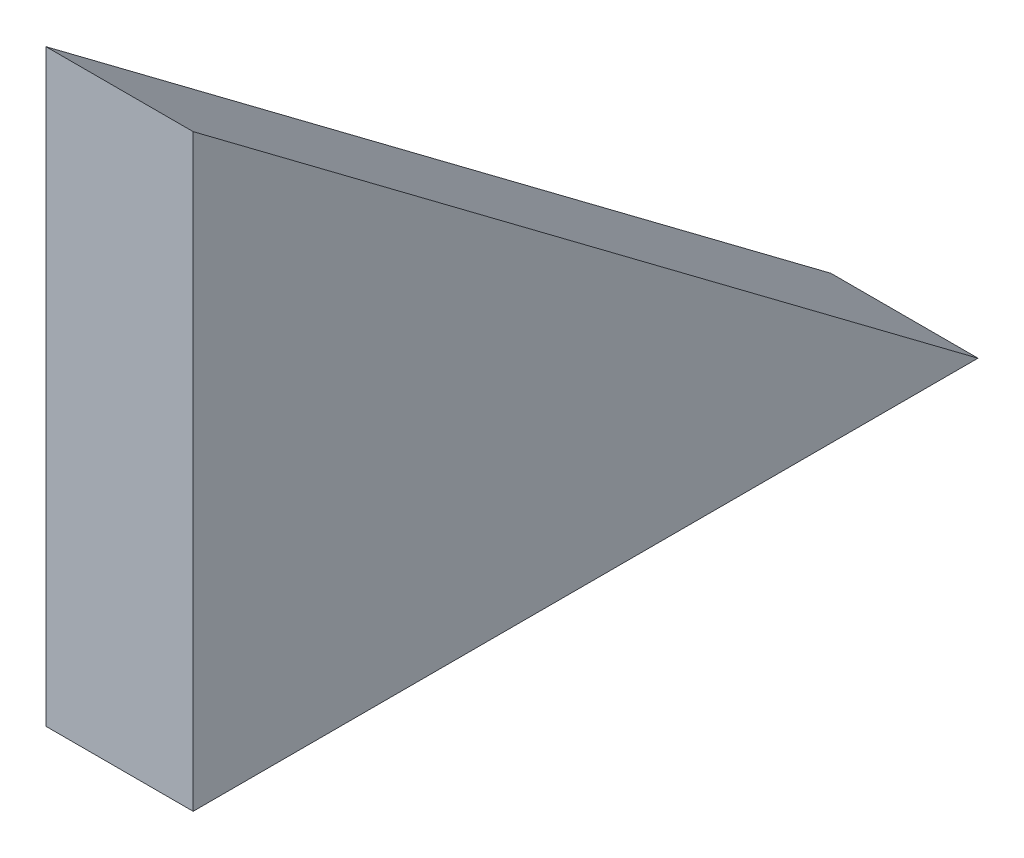
ISO-10303-21;
HEADER;
FILE_DESCRIPTION(('STEP AP214'),'2;1');
FILE_NAME('part.step','',(''),(''),'','','');
FILE_SCHEMA(('AUTOMOTIVE_DESIGN { 1 0 10303 214 1 1 1 1 }'));
ENDSEC;
DATA;
#1=APPLICATION_CONTEXT('core data for automotive mechanical design processes');
#2=APPLICATION_PROTOCOL_DEFINITION('international standard','automotive_design',2000,#1);
#3=PRODUCT_CONTEXT('',#1,'mechanical');
#4=PRODUCT('Part','Part','',(#3));
#5=PRODUCT_RELATED_PRODUCT_CATEGORY('part','',(#4));
#6=PRODUCT_DEFINITION_FORMATION('','',#4);
#7=PRODUCT_DEFINITION_CONTEXT('part definition',#1,'design');
#8=PRODUCT_DEFINITION('design','',#6,#7);
#9=PRODUCT_DEFINITION_SHAPE('','',#8);
#10=(LENGTH_UNIT() NAMED_UNIT(*) SI_UNIT(.MILLI.,.METRE.));
#11=(NAMED_UNIT(*) PLANE_ANGLE_UNIT() SI_UNIT($,.RADIAN.));
#12=(NAMED_UNIT(*) SI_UNIT($,.STERADIAN.) SOLID_ANGLE_UNIT());
#13=UNCERTAINTY_MEASURE_WITH_UNIT(LENGTH_MEASURE(1.E-05),#10,'distance_accuracy_value','');
#14=(GEOMETRIC_REPRESENTATION_CONTEXT(3) GLOBAL_UNCERTAINTY_ASSIGNED_CONTEXT((#13)) GLOBAL_UNIT_ASSIGNED_CONTEXT((#10,
#11,#12)) REPRESENTATION_CONTEXT('',''));
#15=CARTESIAN_POINT('',(0.,0.,0.));
#16=DIRECTION('',(0.,0.,1.));
#17=DIRECTION('',(1.,0.,0.));
#18=AXIS2_PLACEMENT_3D('',#15,#16,#17);
#19=CARTESIAN_POINT('',(9.525,0.,-101.6));
#20=DIRECTION('',(0.,1.,0.));
#21=DIRECTION('',(0.,0.,1.));
#22=AXIS2_PLACEMENT_3D('',#19,#20,#21);
#23=PLANE('',#22);
#24=DIRECTION('',(0.,0.,-1.));
#25=VECTOR('',#24,1.);
#26=CARTESIAN_POINT('',(-9.525,0.,-101.6));
#27=LINE('',#26,#25);
#28=CARTESIAN_POINT('',(-9.525,0.,0.));
#29=VERTEX_POINT('',#28);
#30=CARTESIAN_POINT('',(-9.525,0.,-101.6));
#31=VERTEX_POINT('',#30);
#32=EDGE_CURVE('E86',#29,#31,#27,.T.);
#33=ORIENTED_EDGE('',*,*,#32,.T.);
#34=DIRECTION('',(-1.,0.,0.));
#35=VECTOR('',#34,1.);
#36=CARTESIAN_POINT('',(9.525,0.,-101.6));
#37=LINE('',#36,#35);
#38=CARTESIAN_POINT('',(9.525,0.,-101.6));
#39=VERTEX_POINT('',#38);
#40=EDGE_CURVE('E11',#39,#31,#37,.T.);
#41=ORIENTED_EDGE('',*,*,#40,.F.);
#42=DIRECTION('',(0.,0.,-1.));
#43=VECTOR('',#42,1.);
#44=CARTESIAN_POINT('',(9.525,0.,-101.6));
#45=LINE('',#44,#43);
#46=CARTESIAN_POINT('',(9.525,0.,0.));
#47=VERTEX_POINT('',#46);
#48=EDGE_CURVE('E79',#47,#39,#45,.T.);
#49=ORIENTED_EDGE('',*,*,#48,.F.);
#50=DIRECTION('',(-1.,0.,0.));
#51=VECTOR('',#50,1.);
#52=CARTESIAN_POINT('',(9.525,0.,0.));
#53=LINE('',#52,#51);
#54=EDGE_CURVE('E87',#47,#29,#53,.T.);
#55=ORIENTED_EDGE('',*,*,#54,.T.);
#56=EDGE_LOOP('',(#33,#41,#49,#55));
#57=FACE_BOUND('',#56,.T.);
#58=ADVANCED_FACE('F39',(#57),#23,.F.);
#59=CARTESIAN_POINT('',(9.525,76.2,0.));
#60=DIRECTION('',(0.,-0.8,0.6));
#61=DIRECTION('',(0.,-0.6,-0.8));
#62=AXIS2_PLACEMENT_3D('',#59,#60,#61);
#63=PLANE('',#62);
#64=DIRECTION('',(0.,0.6,0.8));
#65=VECTOR('',#64,1.);
#66=CARTESIAN_POINT('',(-9.525,76.2,0.));
#67=LINE('',#66,#65);
#68=CARTESIAN_POINT('',(-9.525,76.2,0.));
#69=VERTEX_POINT('',#68);
#70=EDGE_CURVE('E67',#31,#69,#67,.T.);
#71=ORIENTED_EDGE('',*,*,#70,.T.);
#72=DIRECTION('',(-1.,0.,0.));
#73=VECTOR('',#72,1.);
#74=CARTESIAN_POINT('',(9.525,76.2,0.));
#75=LINE('',#74,#73);
#76=CARTESIAN_POINT('',(9.525,76.2,0.));
#77=VERTEX_POINT('',#76);
#78=EDGE_CURVE('E47',#77,#69,#75,.T.);
#79=ORIENTED_EDGE('',*,*,#78,.F.);
#80=DIRECTION('',(0.,0.6,0.8));
#81=VECTOR('',#80,1.);
#82=CARTESIAN_POINT('',(9.525,76.2,0.));
#83=LINE('',#82,#81);
#84=EDGE_CURVE('E75',#39,#77,#83,.T.);
#85=ORIENTED_EDGE('',*,*,#84,.F.);
#86=ORIENTED_EDGE('',*,*,#40,.T.);
#87=EDGE_LOOP('',(#71,#79,#85,#86));
#88=FACE_BOUND('',#87,.T.);
#89=ADVANCED_FACE('F76',(#88),#63,.F.);
#90=CARTESIAN_POINT('',(9.525,0.,0.));
#91=DIRECTION('',(0.,0.,-1.));
#92=DIRECTION('',(-1.,0.,0.));
#93=AXIS2_PLACEMENT_3D('',#90,#91,#92);
#94=PLANE('',#93);
#95=DIRECTION('',(0.,-1.,0.));
#96=VECTOR('',#95,1.);
#97=CARTESIAN_POINT('',(-9.525,0.,0.));
#98=LINE('',#97,#96);
#99=EDGE_CURVE('E72',#69,#29,#98,.T.);
#100=ORIENTED_EDGE('',*,*,#99,.T.);
#101=ORIENTED_EDGE('',*,*,#54,.F.);
#102=DIRECTION('',(0.,-1.,0.));
#103=VECTOR('',#102,1.);
#104=CARTESIAN_POINT('',(9.525,0.,0.));
#105=LINE('',#104,#103);
#106=EDGE_CURVE('E55',#77,#47,#105,.T.);
#107=ORIENTED_EDGE('',*,*,#106,.F.);
#108=ORIENTED_EDGE('',*,*,#78,.T.);
#109=EDGE_LOOP('',(#100,#101,#107,#108));
#110=FACE_BOUND('',#109,.T.);
#111=ADVANCED_FACE('F94',(#110),#94,.F.);
#112=CARTESIAN_POINT('',(9.525,0.,0.));
#113=DIRECTION('',(-1.,0.,0.));
#114=DIRECTION('',(0.,0.,1.));
#115=AXIS2_PLACEMENT_3D('',#112,#113,#114);
#116=PLANE('',#115);
#117=ORIENTED_EDGE('',*,*,#48,.T.);
#118=ORIENTED_EDGE('',*,*,#84,.T.);
#119=ORIENTED_EDGE('',*,*,#106,.T.);
#120=EDGE_LOOP('',(#117,#118,#119));
#121=FACE_BOUND('',#120,.T.);
#122=ADVANCED_FACE('F82',(#121),#116,.F.);
#123=CARTESIAN_POINT('',(-9.525,0.,0.));
#124=DIRECTION('',(-1.,0.,0.));
#125=DIRECTION('',(0.,0.,1.));
#126=AXIS2_PLACEMENT_3D('',#123,#124,#125);
#127=PLANE('',#126);
#128=ORIENTED_EDGE('',*,*,#32,.F.);
#129=ORIENTED_EDGE('',*,*,#99,.F.);
#130=ORIENTED_EDGE('',*,*,#70,.F.);
#131=EDGE_LOOP('',(#128,#129,#130));
#132=FACE_BOUND('',#131,.T.);
#133=ADVANCED_FACE('F95',(#132),#127,.T.);
#134=CLOSED_SHELL('',(#58,#89,#111,#122,#133));
#135=MANIFOLD_SOLID_BREP('B2',#134);
#136=ADVANCED_BREP_SHAPE_REPRESENTATION('',(#18,#135),#14);
#137=SHAPE_DEFINITION_REPRESENTATION(#9,#136);
ENDSEC;
END-ISO-10303-21;
